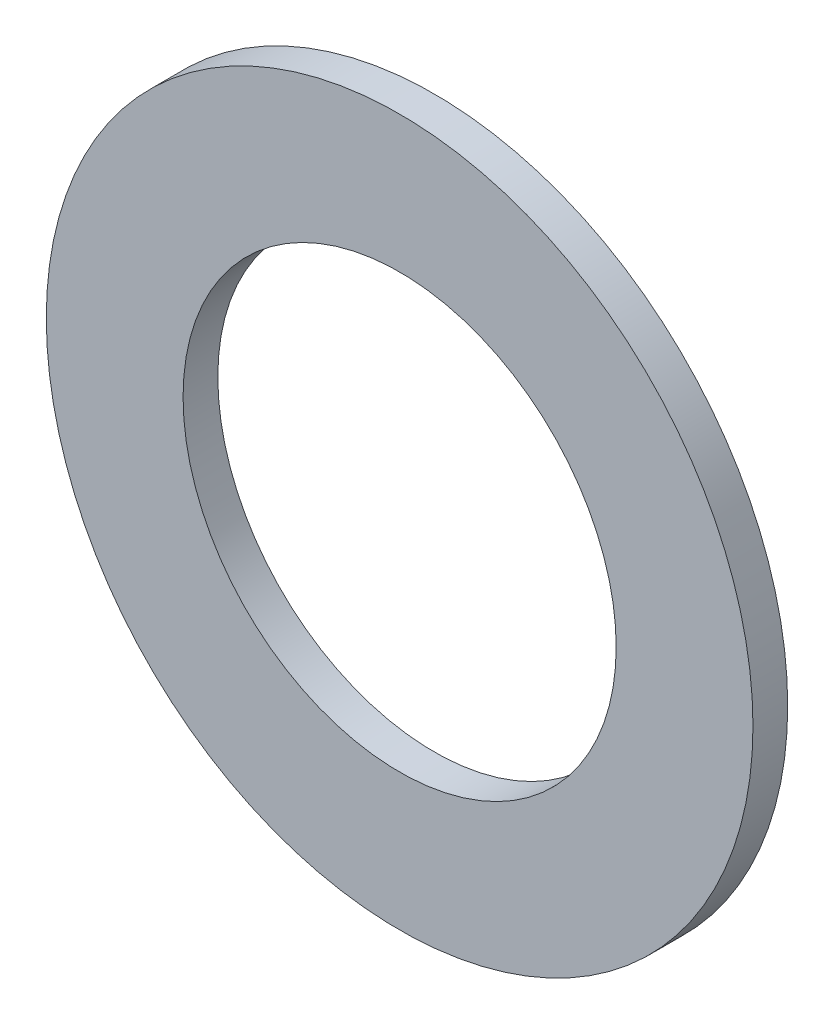
ISO-10303-21;
HEADER;
FILE_DESCRIPTION(('STEP AP214'),'2;1');
FILE_NAME('part.step','',(''),(''),'','','');
FILE_SCHEMA(('AUTOMOTIVE_DESIGN { 1 0 10303 214 1 1 1 1 }'));
ENDSEC;
DATA;
#1=APPLICATION_CONTEXT('core data for automotive mechanical design processes');
#2=APPLICATION_PROTOCOL_DEFINITION('international standard','automotive_design',2000,#1);
#3=PRODUCT_CONTEXT('',#1,'mechanical');
#4=PRODUCT('Part','Part','',(#3));
#5=PRODUCT_RELATED_PRODUCT_CATEGORY('part','',(#4));
#6=PRODUCT_DEFINITION_FORMATION('','',#4);
#7=PRODUCT_DEFINITION_CONTEXT('part definition',#1,'design');
#8=PRODUCT_DEFINITION('design','',#6,#7);
#9=PRODUCT_DEFINITION_SHAPE('','',#8);
#10=(LENGTH_UNIT() NAMED_UNIT(*) SI_UNIT(.MILLI.,.METRE.));
#11=(NAMED_UNIT(*) PLANE_ANGLE_UNIT() SI_UNIT($,.RADIAN.));
#12=(NAMED_UNIT(*) SI_UNIT($,.STERADIAN.) SOLID_ANGLE_UNIT());
#13=UNCERTAINTY_MEASURE_WITH_UNIT(LENGTH_MEASURE(1.E-05),#10,'distance_accuracy_value','');
#14=(GEOMETRIC_REPRESENTATION_CONTEXT(3) GLOBAL_UNCERTAINTY_ASSIGNED_CONTEXT((#13)) GLOBAL_UNIT_ASSIGNED_CONTEXT((#10,
#11,#12)) REPRESENTATION_CONTEXT('',''));
#15=CARTESIAN_POINT('',(0.,0.,0.));
#16=DIRECTION('',(0.,0.,1.));
#17=DIRECTION('',(1.,0.,0.));
#18=AXIS2_PLACEMENT_3D('',#15,#16,#17);
#19=CARTESIAN_POINT('',(0.,0.,0.));
#20=DIRECTION('',(0.,0.,1.));
#21=DIRECTION('',(1.,0.,0.));
#22=AXIS2_PLACEMENT_3D('',#19,#20,#21);
#23=PLANE('',#22);
#24=CARTESIAN_POINT('',(0.,0.,0.));
#25=DIRECTION('',(0.,0.,-1.));
#26=DIRECTION('',(-1.,0.,0.));
#27=AXIS2_PLACEMENT_3D('',#24,#25,#26);
#28=CIRCLE('',#27,9.5);
#29=CARTESIAN_POINT('',(-9.5,0.,0.));
#30=VERTEX_POINT('',#29);
#31=EDGE_CURVE('E24',#30,#30,#28,.F.);
#32=ORIENTED_EDGE('',*,*,#31,.T.);
#33=EDGE_LOOP('',(#32));
#34=FACE_BOUND('',#33,.T.);
#35=CARTESIAN_POINT('',(0.,0.,0.));
#36=DIRECTION('',(0.,0.,-1.));
#37=DIRECTION('',(-1.,0.,0.));
#38=AXIS2_PLACEMENT_3D('',#35,#36,#37);
#39=CIRCLE('',#38,15.5);
#40=CARTESIAN_POINT('',(-15.5,0.,0.));
#41=VERTEX_POINT('',#40);
#42=EDGE_CURVE('E15',#41,#41,#39,.F.);
#43=ORIENTED_EDGE('',*,*,#42,.F.);
#44=EDGE_LOOP('',(#43));
#45=FACE_BOUND('',#44,.T.);
#46=ADVANCED_FACE('F12',(#34,#45),#23,.F.);
#47=CARTESIAN_POINT('',(0.,0.,1.524));
#48=DIRECTION('',(0.,0.,-1.));
#49=DIRECTION('',(-1.,0.,0.));
#50=AXIS2_PLACEMENT_3D('',#47,#48,#49);
#51=CYLINDRICAL_SURFACE('',#50,15.5);
#52=ORIENTED_EDGE('',*,*,#42,.T.);
#53=EDGE_LOOP('',(#52));
#54=FACE_BOUND('',#53,.T.);
#55=CARTESIAN_POINT('',(0.,0.,1.524));
#56=DIRECTION('',(0.,0.,-1.));
#57=DIRECTION('',(-1.,0.,0.));
#58=AXIS2_PLACEMENT_3D('',#55,#56,#57);
#59=CIRCLE('',#58,15.5);
#60=CARTESIAN_POINT('',(-15.5,0.,1.524));
#61=VERTEX_POINT('',#60);
#62=EDGE_CURVE('E19',#61,#61,#59,.F.);
#63=ORIENTED_EDGE('',*,*,#62,.F.);
#64=EDGE_LOOP('',(#63));
#65=FACE_BOUND('',#64,.T.);
#66=ADVANCED_FACE('F32',(#54,#65),#51,.T.);
#67=CARTESIAN_POINT('',(0.,0.,1.524));
#68=DIRECTION('',(0.,0.,-1.));
#69=DIRECTION('',(-1.,0.,0.));
#70=AXIS2_PLACEMENT_3D('',#67,#68,#69);
#71=CYLINDRICAL_SURFACE('',#70,9.5);
#72=CARTESIAN_POINT('',(0.,0.,1.524));
#73=DIRECTION('',(0.,0.,-1.));
#74=DIRECTION('',(-1.,0.,0.));
#75=AXIS2_PLACEMENT_3D('',#72,#73,#74);
#76=CIRCLE('',#75,9.5);
#77=CARTESIAN_POINT('',(-9.5,0.,1.524));
#78=VERTEX_POINT('',#77);
#79=EDGE_CURVE('E8',#78,#78,#76,.T.);
#80=ORIENTED_EDGE('',*,*,#79,.F.);
#81=EDGE_LOOP('',(#80));
#82=FACE_BOUND('',#81,.T.);
#83=ORIENTED_EDGE('',*,*,#31,.F.);
#84=EDGE_LOOP('',(#83));
#85=FACE_BOUND('',#84,.T.);
#86=ADVANCED_FACE('F40',(#82,#85),#71,.F.);
#87=CARTESIAN_POINT('',(0.,0.,1.524));
#88=DIRECTION('',(0.,0.,1.));
#89=DIRECTION('',(1.,0.,0.));
#90=AXIS2_PLACEMENT_3D('',#87,#88,#89);
#91=PLANE('',#90);
#92=ORIENTED_EDGE('',*,*,#79,.T.);
#93=EDGE_LOOP('',(#92));
#94=FACE_BOUND('',#93,.T.);
#95=ORIENTED_EDGE('',*,*,#62,.T.);
#96=EDGE_LOOP('',(#95));
#97=FACE_BOUND('',#96,.T.);
#98=ADVANCED_FACE('F41',(#94,#97),#91,.T.);
#99=CLOSED_SHELL('',(#46,#66,#86,#98));
#100=MANIFOLD_SOLID_BREP('B1',#99);
#101=ADVANCED_BREP_SHAPE_REPRESENTATION('',(#18,#100),#14);
#102=SHAPE_DEFINITION_REPRESENTATION(#9,#101);
ENDSEC;
END-ISO-10303-21;
